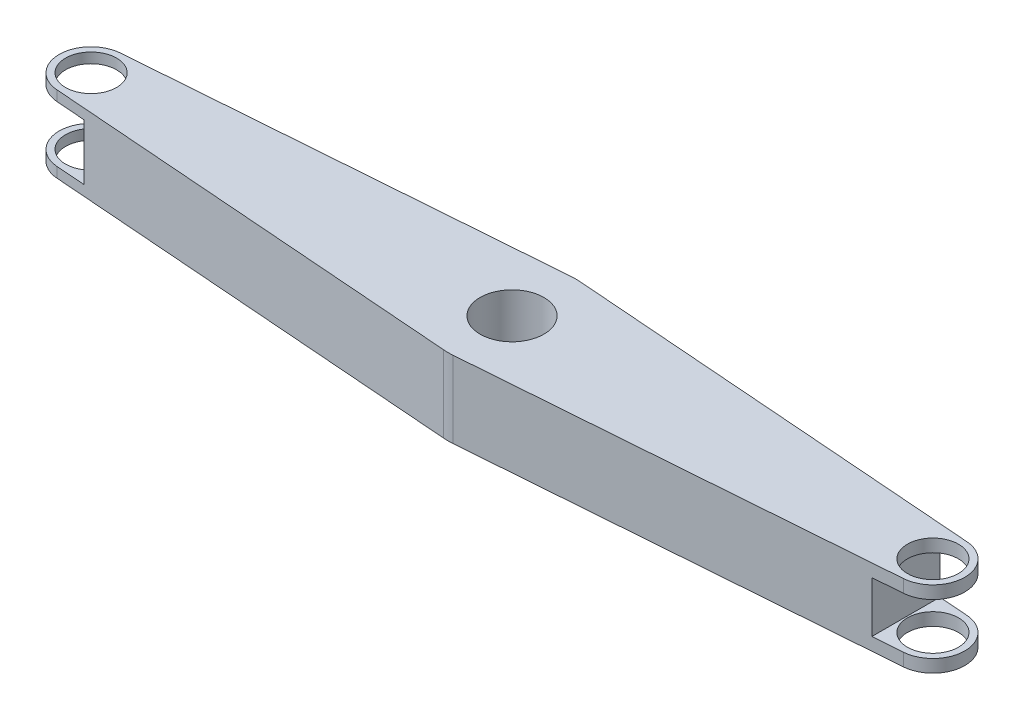
ISO-10303-21;
HEADER;
FILE_DESCRIPTION(('STEP AP214'),'2;1');
FILE_NAME('part.step','',(''),(''),'','','');
FILE_SCHEMA(('AUTOMOTIVE_DESIGN { 1 0 10303 214 1 1 1 1 }'));
ENDSEC;
DATA;
#1=APPLICATION_CONTEXT('core data for automotive mechanical design processes');
#2=APPLICATION_PROTOCOL_DEFINITION('international standard','automotive_design',2000,#1);
#3=PRODUCT_CONTEXT('',#1,'mechanical');
#4=PRODUCT('Part','Part','',(#3));
#5=PRODUCT_RELATED_PRODUCT_CATEGORY('part','',(#4));
#6=PRODUCT_DEFINITION_FORMATION('','',#4);
#7=PRODUCT_DEFINITION_CONTEXT('part definition',#1,'design');
#8=PRODUCT_DEFINITION('design','',#6,#7);
#9=PRODUCT_DEFINITION_SHAPE('','',#8);
#10=(LENGTH_UNIT() NAMED_UNIT(*) SI_UNIT(.MILLI.,.METRE.));
#11=(NAMED_UNIT(*) PLANE_ANGLE_UNIT() SI_UNIT($,.RADIAN.));
#12=(NAMED_UNIT(*) SI_UNIT($,.STERADIAN.) SOLID_ANGLE_UNIT());
#13=UNCERTAINTY_MEASURE_WITH_UNIT(LENGTH_MEASURE(1.E-05),#10,'distance_accuracy_value','');
#14=(GEOMETRIC_REPRESENTATION_CONTEXT(3) GLOBAL_UNCERTAINTY_ASSIGNED_CONTEXT((#13)) GLOBAL_UNIT_ASSIGNED_CONTEXT((#10,
#11,#12)) REPRESENTATION_CONTEXT('',''));
#15=CARTESIAN_POINT('',(0.,0.,0.));
#16=DIRECTION('',(0.,0.,1.));
#17=DIRECTION('',(1.,0.,0.));
#18=AXIS2_PLACEMENT_3D('',#15,#16,#17);
#19=CARTESIAN_POINT('',(-165.,15.,0.));
#20=DIRECTION('',(0.,-1.,0.));
#21=DIRECTION('',(0.,0.,-1.));
#22=AXIS2_PLACEMENT_3D('',#19,#20,#21);
#23=CYLINDRICAL_SURFACE('',#22,12.5);
#24=DIRECTION('',(0.,-1.,0.));
#25=VECTOR('',#24,1.);
#26=CARTESIAN_POINT('',(-165.94696969697,15.,-12.4640783210401));
#27=LINE('',#26,#25);
#28=CARTESIAN_POINT('',(-165.94696969697,15.,-12.4640783210401));
#29=VERTEX_POINT('',#28);
#30=CARTESIAN_POINT('',(-165.94696969697,11.,-12.4640783210401));
#31=VERTEX_POINT('',#30);
#32=EDGE_CURVE('E240',#29,#31,#27,.T.);
#33=ORIENTED_EDGE('',*,*,#32,.T.);
#34=CARTESIAN_POINT('',(-165.,11.,0.));
#35=DIRECTION('',(0.,1.,0.));
#36=DIRECTION('',(0.,0.,1.));
#37=AXIS2_PLACEMENT_3D('',#34,#35,#36);
#38=CIRCLE('',#37,12.5);
#39=CARTESIAN_POINT('',(-165.94696969697,11.,12.4640783210401));
#40=VERTEX_POINT('',#39);
#41=EDGE_CURVE('E175',#31,#40,#38,.T.);
#42=ORIENTED_EDGE('',*,*,#41,.T.);
#43=DIRECTION('',(0.,-1.,0.));
#44=VECTOR('',#43,1.);
#45=CARTESIAN_POINT('',(-165.94696969697,15.,12.4640783210401));
#46=LINE('',#45,#44);
#47=CARTESIAN_POINT('',(-165.94696969697,15.,12.4640783210401));
#48=VERTEX_POINT('',#47);
#49=EDGE_CURVE('E264',#48,#40,#46,.T.);
#50=ORIENTED_EDGE('',*,*,#49,.F.);
#51=CARTESIAN_POINT('',(-165.,15.,0.));
#52=DIRECTION('',(0.,1.,0.));
#53=DIRECTION('',(0.,0.,1.));
#54=AXIS2_PLACEMENT_3D('',#51,#52,#53);
#55=CIRCLE('',#54,12.5);
#56=EDGE_CURVE('E203',#29,#48,#55,.T.);
#57=ORIENTED_EDGE('',*,*,#56,.F.);
#58=EDGE_LOOP('',(#33,#42,#50,#57));
#59=FACE_BOUND('',#58,.T.);
#60=ADVANCED_FACE('F39',(#59),#23,.T.);
#61=CARTESIAN_POINT('',(165.,15.,0.));
#62=DIRECTION('',(0.,-1.,0.));
#63=DIRECTION('',(0.,0.,-1.));
#64=AXIS2_PLACEMENT_3D('',#61,#62,#63);
#65=CYLINDRICAL_SURFACE('',#64,12.5);
#66=DIRECTION('',(0.,-1.,0.));
#67=VECTOR('',#66,1.);
#68=CARTESIAN_POINT('',(165.94696969697,15.,-12.4640783210401));
#69=LINE('',#68,#67);
#70=CARTESIAN_POINT('',(165.94696969697,-10.,-12.4640783210401));
#71=VERTEX_POINT('',#70);
#72=CARTESIAN_POINT('',(165.94696969697,-15.,-12.4640783210401));
#73=VERTEX_POINT('',#72);
#74=EDGE_CURVE('E249',#71,#73,#69,.T.);
#75=ORIENTED_EDGE('',*,*,#74,.F.);
#76=CARTESIAN_POINT('',(165.,-10.,0.));
#77=DIRECTION('',(0.,-1.,0.));
#78=DIRECTION('',(1.,0.,0.));
#79=AXIS2_PLACEMENT_3D('',#76,#77,#78);
#80=CIRCLE('',#79,12.5);
#81=CARTESIAN_POINT('',(165.94696969697,-10.,12.4640783210401));
#82=VERTEX_POINT('',#81);
#83=EDGE_CURVE('E190',#71,#82,#80,.T.);
#84=ORIENTED_EDGE('',*,*,#83,.T.);
#85=DIRECTION('',(0.,-1.,0.));
#86=VECTOR('',#85,1.);
#87=CARTESIAN_POINT('',(165.94696969697,15.,12.4640783210401));
#88=LINE('',#87,#86);
#89=CARTESIAN_POINT('',(165.94696969697,-15.,12.4640783210401));
#90=VERTEX_POINT('',#89);
#91=EDGE_CURVE('E253',#82,#90,#88,.T.);
#92=ORIENTED_EDGE('',*,*,#91,.T.);
#93=CARTESIAN_POINT('',(165.,-15.,0.));
#94=DIRECTION('',(0.,1.,0.));
#95=DIRECTION('',(0.,0.,1.));
#96=AXIS2_PLACEMENT_3D('',#93,#94,#95);
#97=CIRCLE('',#96,12.5);
#98=EDGE_CURVE('E231',#90,#73,#97,.T.);
#99=ORIENTED_EDGE('',*,*,#98,.T.);
#100=EDGE_LOOP('',(#75,#84,#92,#99));
#101=FACE_BOUND('',#100,.T.);
#102=ADVANCED_FACE('F347',(#101),#65,.T.);
#103=CARTESIAN_POINT('',(-165.,15.,0.));
#104=DIRECTION('',(0.,1.,0.));
#105=DIRECTION('',(0.,0.,1.));
#106=AXIS2_PLACEMENT_3D('',#103,#104,#105);
#107=PLANE('',#106);
#108=CARTESIAN_POINT('',(-165.,15.,0.));
#109=DIRECTION('',(0.,1.,0.));
#110=DIRECTION('',(0.,0.,1.));
#111=AXIS2_PLACEMENT_3D('',#108,#109,#110);
#112=CIRCLE('',#111,10.);
#113=CARTESIAN_POINT('',(-165.,15.,10.));
#114=VERTEX_POINT('',#113);
#115=EDGE_CURVE('E285',#114,#114,#112,.T.);
#116=ORIENTED_EDGE('',*,*,#115,.F.);
#117=EDGE_LOOP('',(#116));
#118=FACE_BOUND('',#117,.T.);
#119=CARTESIAN_POINT('',(165.,15.,0.));
#120=DIRECTION('',(0.,1.,0.));
#121=DIRECTION('',(0.,0.,1.));
#122=AXIS2_PLACEMENT_3D('',#119,#120,#121);
#123=CIRCLE('',#122,10.);
#124=CARTESIAN_POINT('',(165.,15.,10.));
#125=VERTEX_POINT('',#124);
#126=EDGE_CURVE('E290',#125,#125,#123,.T.);
#127=ORIENTED_EDGE('',*,*,#126,.F.);
#128=EDGE_LOOP('',(#127));
#129=FACE_BOUND('',#128,.T.);
#130=ORIENTED_EDGE('',*,*,#56,.T.);
#131=DIRECTION('',(0.997126265683206,0.,0.0757575757575758));
#132=VECTOR('',#131,1.);
#133=CARTESIAN_POINT('',(-165.94696969697,15.,12.4640783210401));
#134=LINE('',#133,#132);
#135=CARTESIAN_POINT('',(-1.8939393939394,15.,24.9281566420802));
#136=VERTEX_POINT('',#135);
#137=EDGE_CURVE('E206',#48,#136,#134,.T.);
#138=ORIENTED_EDGE('',*,*,#137,.T.);
#139=CARTESIAN_POINT('',(0.,15.,0.));
#140=DIRECTION('',(0.,1.,0.));
#141=DIRECTION('',(0.,0.,1.));
#142=AXIS2_PLACEMENT_3D('',#139,#140,#141);
#143=CIRCLE('',#142,25.);
#144=CARTESIAN_POINT('',(1.8939393939394,15.,24.9281566420802));
#145=VERTEX_POINT('',#144);
#146=EDGE_CURVE('E209',#136,#145,#143,.T.);
#147=ORIENTED_EDGE('',*,*,#146,.T.);
#148=DIRECTION('',(0.997126265683206,0.,-0.0757575757575758));
#149=VECTOR('',#148,1.);
#150=CARTESIAN_POINT('',(165.94696969697,15.,12.4640783210401));
#151=LINE('',#150,#149);
#152=CARTESIAN_POINT('',(165.94696969697,15.,12.4640783210401));
#153=VERTEX_POINT('',#152);
#154=EDGE_CURVE('E211',#145,#153,#151,.T.);
#155=ORIENTED_EDGE('',*,*,#154,.T.);
#156=CARTESIAN_POINT('',(165.,15.,0.));
#157=DIRECTION('',(0.,1.,0.));
#158=DIRECTION('',(0.,0.,1.));
#159=AXIS2_PLACEMENT_3D('',#156,#157,#158);
#160=CIRCLE('',#159,12.5);
#161=CARTESIAN_POINT('',(165.94696969697,15.,-12.4640783210401));
#162=VERTEX_POINT('',#161);
#163=EDGE_CURVE('E213',#153,#162,#160,.T.);
#164=ORIENTED_EDGE('',*,*,#163,.T.);
#165=DIRECTION('',(-0.997126265683206,0.,-0.0757575757575758));
#166=VECTOR('',#165,1.);
#167=CARTESIAN_POINT('',(165.94696969697,15.,-12.4640783210401));
#168=LINE('',#167,#166);
#169=CARTESIAN_POINT('',(1.89393939393939,15.,-24.9281566420802));
#170=VERTEX_POINT('',#169);
#171=EDGE_CURVE('E215',#162,#170,#168,.T.);
#172=ORIENTED_EDGE('',*,*,#171,.T.);
#173=CARTESIAN_POINT('',(0.,15.,0.));
#174=DIRECTION('',(0.,1.,0.));
#175=DIRECTION('',(0.,0.,1.));
#176=AXIS2_PLACEMENT_3D('',#173,#174,#175);
#177=CIRCLE('',#176,25.);
#178=CARTESIAN_POINT('',(-1.8939393939394,15.,-24.9281566420802));
#179=VERTEX_POINT('',#178);
#180=EDGE_CURVE('E217',#170,#179,#177,.T.);
#181=ORIENTED_EDGE('',*,*,#180,.T.);
#182=DIRECTION('',(-0.997126265683206,0.,0.0757575757575758));
#183=VECTOR('',#182,1.);
#184=CARTESIAN_POINT('',(-165.94696969697,15.,-12.4640783210401));
#185=LINE('',#184,#183);
#186=EDGE_CURVE('E219',#179,#29,#185,.T.);
#187=ORIENTED_EDGE('',*,*,#186,.T.);
#188=EDGE_LOOP('',(#130,#138,#147,#155,#164,#172,#181,#187));
#189=FACE_BOUND('',#188,.T.);
#190=CARTESIAN_POINT('',(0.,15.,0.));
#191=DIRECTION('',(0.,1.,0.));
#192=DIRECTION('',(0.,0.,1.));
#193=AXIS2_PLACEMENT_3D('',#190,#191,#192);
#194=CIRCLE('',#193,12.5);
#195=CARTESIAN_POINT('',(0.,15.,12.5));
#196=VERTEX_POINT('',#195);
#197=EDGE_CURVE('E197',#196,#196,#194,.T.);
#198=ORIENTED_EDGE('',*,*,#197,.F.);
#199=EDGE_LOOP('',(#198));
#200=FACE_BOUND('',#199,.T.);
#201=ADVANCED_FACE('F327',(#118,#129,#189,#200),#107,.T.);
#202=CARTESIAN_POINT('',(-165.,-15.,0.));
#203=DIRECTION('',(0.,1.,0.));
#204=DIRECTION('',(0.,0.,1.));
#205=AXIS2_PLACEMENT_3D('',#202,#203,#204);
#206=PLANE('',#205);
#207=CARTESIAN_POINT('',(-165.,-15.,0.));
#208=DIRECTION('',(0.,1.,0.));
#209=DIRECTION('',(0.,0.,1.));
#210=AXIS2_PLACEMENT_3D('',#207,#208,#209);
#211=CIRCLE('',#210,10.);
#212=CARTESIAN_POINT('',(-165.,-15.,10.));
#213=VERTEX_POINT('',#212);
#214=EDGE_CURVE('E279',#213,#213,#211,.T.);
#215=ORIENTED_EDGE('',*,*,#214,.T.);
#216=EDGE_LOOP('',(#215));
#217=FACE_BOUND('',#216,.T.);
#218=CARTESIAN_POINT('',(165.,-15.,0.));
#219=DIRECTION('',(0.,1.,0.));
#220=DIRECTION('',(0.,0.,1.));
#221=AXIS2_PLACEMENT_3D('',#218,#219,#220);
#222=CIRCLE('',#221,10.);
#223=CARTESIAN_POINT('',(165.,-15.,10.));
#224=VERTEX_POINT('',#223);
#225=EDGE_CURVE('E293',#224,#224,#222,.T.);
#226=ORIENTED_EDGE('',*,*,#225,.T.);
#227=EDGE_LOOP('',(#226));
#228=FACE_BOUND('',#227,.T.);
#229=CARTESIAN_POINT('',(-165.,-15.,0.));
#230=DIRECTION('',(0.,1.,0.));
#231=DIRECTION('',(0.,0.,1.));
#232=AXIS2_PLACEMENT_3D('',#229,#230,#231);
#233=CIRCLE('',#232,12.5);
#234=CARTESIAN_POINT('',(-165.94696969697,-15.,-12.4640783210401));
#235=VERTEX_POINT('',#234);
#236=CARTESIAN_POINT('',(-165.94696969697,-15.,12.4640783210401));
#237=VERTEX_POINT('',#236);
#238=EDGE_CURVE('E200',#235,#237,#233,.T.);
#239=ORIENTED_EDGE('',*,*,#238,.F.);
#240=DIRECTION('',(-0.997126265683206,0.,0.0757575757575758));
#241=VECTOR('',#240,1.);
#242=CARTESIAN_POINT('',(-165.94696969697,-15.,-12.4640783210401));
#243=LINE('',#242,#241);
#244=CARTESIAN_POINT('',(-1.8939393939394,-15.,-24.9281566420802));
#245=VERTEX_POINT('',#244);
#246=EDGE_CURVE('E207',#245,#235,#243,.T.);
#247=ORIENTED_EDGE('',*,*,#246,.F.);
#248=CARTESIAN_POINT('',(0.,-15.,0.));
#249=DIRECTION('',(0.,1.,0.));
#250=DIRECTION('',(0.,0.,1.));
#251=AXIS2_PLACEMENT_3D('',#248,#249,#250);
#252=CIRCLE('',#251,25.);
#253=CARTESIAN_POINT('',(1.89393939393939,-15.,-24.9281566420802));
#254=VERTEX_POINT('',#253);
#255=EDGE_CURVE('E236',#254,#245,#252,.T.);
#256=ORIENTED_EDGE('',*,*,#255,.F.);
#257=DIRECTION('',(-0.997126265683206,0.,-0.0757575757575758));
#258=VECTOR('',#257,1.);
#259=CARTESIAN_POINT('',(165.94696969697,-15.,-12.4640783210401));
#260=LINE('',#259,#258);
#261=EDGE_CURVE('E234',#73,#254,#260,.T.);
#262=ORIENTED_EDGE('',*,*,#261,.F.);
#263=ORIENTED_EDGE('',*,*,#98,.F.);
#264=DIRECTION('',(0.997126265683206,0.,-0.0757575757575758));
#265=VECTOR('',#264,1.);
#266=CARTESIAN_POINT('',(165.94696969697,-15.,12.4640783210401));
#267=LINE('',#266,#265);
#268=CARTESIAN_POINT('',(1.8939393939394,-15.,24.9281566420802));
#269=VERTEX_POINT('',#268);
#270=EDGE_CURVE('E228',#269,#90,#267,.T.);
#271=ORIENTED_EDGE('',*,*,#270,.F.);
#272=CARTESIAN_POINT('',(0.,-15.,0.));
#273=DIRECTION('',(0.,1.,0.));
#274=DIRECTION('',(0.,0.,1.));
#275=AXIS2_PLACEMENT_3D('',#272,#273,#274);
#276=CIRCLE('',#275,25.);
#277=CARTESIAN_POINT('',(-1.8939393939394,-15.,24.9281566420802));
#278=VERTEX_POINT('',#277);
#279=EDGE_CURVE('E226',#278,#269,#276,.T.);
#280=ORIENTED_EDGE('',*,*,#279,.F.);
#281=DIRECTION('',(0.997126265683206,0.,0.0757575757575758));
#282=VECTOR('',#281,1.);
#283=CARTESIAN_POINT('',(-165.94696969697,-15.,12.4640783210401));
#284=LINE('',#283,#282);
#285=EDGE_CURVE('E224',#237,#278,#284,.T.);
#286=ORIENTED_EDGE('',*,*,#285,.F.);
#287=EDGE_LOOP('',(#239,#247,#256,#262,#263,#271,#280,#286));
#288=FACE_BOUND('',#287,.T.);
#289=CARTESIAN_POINT('',(0.,-15.,0.));
#290=DIRECTION('',(0.,1.,0.));
#291=DIRECTION('',(0.,0.,1.));
#292=AXIS2_PLACEMENT_3D('',#289,#290,#291);
#293=CIRCLE('',#292,12.5);
#294=CARTESIAN_POINT('',(0.,-15.,12.5));
#295=VERTEX_POINT('',#294);
#296=EDGE_CURVE('E196',#295,#295,#293,.T.);
#297=ORIENTED_EDGE('',*,*,#296,.T.);
#298=EDGE_LOOP('',(#297));
#299=FACE_BOUND('',#298,.T.);
#300=ADVANCED_FACE('F316',(#217,#228,#288,#299),#206,.F.);
#301=CARTESIAN_POINT('',(-165.94696969697,-11.,12.4640783210401));
#302=VERTEX_POINT('',#301);
#303=EDGE_CURVE('E263',#302,#237,#46,.T.);
#304=ORIENTED_EDGE('',*,*,#303,.F.);
#305=CARTESIAN_POINT('',(-165.,-11.,0.));
#306=DIRECTION('',(0.,-1.,0.));
#307=DIRECTION('',(0.,0.,-1.));
#308=AXIS2_PLACEMENT_3D('',#305,#306,#307);
#309=CIRCLE('',#308,12.5);
#310=CARTESIAN_POINT('',(-165.94696969697,-11.,-12.4640783210401));
#311=VERTEX_POINT('',#310);
#312=EDGE_CURVE('E156',#302,#311,#309,.T.);
#313=ORIENTED_EDGE('',*,*,#312,.T.);
#314=EDGE_CURVE('E221',#311,#235,#27,.T.);
#315=ORIENTED_EDGE('',*,*,#314,.T.);
#316=ORIENTED_EDGE('',*,*,#238,.T.);
#317=EDGE_LOOP('',(#304,#313,#315,#316));
#318=FACE_BOUND('',#317,.T.);
#319=ADVANCED_FACE('F41',(#318),#23,.T.);
#320=CARTESIAN_POINT('',(-165.94696969697,15.,12.4640783210401));
#321=DIRECTION('',(0.0757575757575758,0.,-0.997126265683206));
#322=DIRECTION('',(-0.997126265683206,0.,-0.0757575757575758));
#323=AXIS2_PLACEMENT_3D('',#320,#321,#322);
#324=PLANE('',#323);
#325=ORIENTED_EDGE('',*,*,#49,.T.);
#326=DIRECTION('',(0.997126265683206,0.,0.0757575757575758));
#327=VECTOR('',#326,1.);
#328=CARTESIAN_POINT('',(-165.94696969697,11.,12.4640783210401));
#329=LINE('',#328,#327);
#330=CARTESIAN_POINT('',(-154.393939393939,11.,13.3418303154795));
#331=VERTEX_POINT('',#330);
#332=EDGE_CURVE('E174',#40,#331,#329,.T.);
#333=ORIENTED_EDGE('',*,*,#332,.T.);
#334=DIRECTION('',(0.,-1.,0.));
#335=VECTOR('',#334,1.);
#336=CARTESIAN_POINT('',(-154.393939393939,15.,13.3418303154795));
#337=LINE('',#336,#335);
#338=CARTESIAN_POINT('',(-154.393939393939,-11.,13.3418303154795));
#339=VERTEX_POINT('',#338);
#340=EDGE_CURVE('E160',#331,#339,#337,.T.);
#341=ORIENTED_EDGE('',*,*,#340,.T.);
#342=DIRECTION('',(-0.997126265683206,0.,-0.0757575757575758));
#343=VECTOR('',#342,1.);
#344=CARTESIAN_POINT('',(-165.94696969697,-11.,12.4640783210401));
#345=LINE('',#344,#343);
#346=EDGE_CURVE('E154',#339,#302,#345,.T.);
#347=ORIENTED_EDGE('',*,*,#346,.T.);
#348=ORIENTED_EDGE('',*,*,#303,.T.);
#349=ORIENTED_EDGE('',*,*,#285,.T.);
#350=DIRECTION('',(0.,-1.,0.));
#351=VECTOR('',#350,1.);
#352=CARTESIAN_POINT('',(-1.8939393939394,15.,24.9281566420802));
#353=LINE('',#352,#351);
#354=EDGE_CURVE('E260',#136,#278,#353,.T.);
#355=ORIENTED_EDGE('',*,*,#354,.F.);
#356=ORIENTED_EDGE('',*,*,#137,.F.);
#357=EDGE_LOOP('',(#325,#333,#341,#347,#348,#349,#355,#356));
#358=FACE_BOUND('',#357,.T.);
#359=ADVANCED_FACE('F173',(#358),#324,.F.);
#360=CARTESIAN_POINT('',(0.,15.,0.));
#361=DIRECTION('',(0.,-1.,0.));
#362=DIRECTION('',(0.,0.,-1.));
#363=AXIS2_PLACEMENT_3D('',#360,#361,#362);
#364=CYLINDRICAL_SURFACE('',#363,25.);
#365=ORIENTED_EDGE('',*,*,#279,.T.);
#366=DIRECTION('',(0.,-1.,0.));
#367=VECTOR('',#366,1.);
#368=CARTESIAN_POINT('',(1.8939393939394,15.,24.9281566420802));
#369=LINE('',#368,#367);
#370=EDGE_CURVE('E257',#145,#269,#369,.T.);
#371=ORIENTED_EDGE('',*,*,#370,.F.);
#372=ORIENTED_EDGE('',*,*,#146,.F.);
#373=ORIENTED_EDGE('',*,*,#354,.T.);
#374=EDGE_LOOP('',(#365,#371,#372,#373));
#375=FACE_BOUND('',#374,.T.);
#376=ADVANCED_FACE('F323',(#375),#364,.T.);
#377=CARTESIAN_POINT('',(165.94696969697,15.,12.4640783210401));
#378=DIRECTION('',(-0.0757575757575758,0.,-0.997126265683206));
#379=DIRECTION('',(-0.997126265683206,0.,0.0757575757575758));
#380=AXIS2_PLACEMENT_3D('',#377,#378,#379);
#381=PLANE('',#380);
#382=ORIENTED_EDGE('',*,*,#91,.F.);
#383=DIRECTION('',(-0.997126265683206,0.,0.0757575757575758));
#384=VECTOR('',#383,1.);
#385=CARTESIAN_POINT('',(165.94696969697,-10.,12.4640783210401));
#386=LINE('',#385,#384);
#387=CARTESIAN_POINT('',(154.393939393939,-10.,13.3418303154795));
#388=VERTEX_POINT('',#387);
#389=EDGE_CURVE('E193',#82,#388,#386,.T.);
#390=ORIENTED_EDGE('',*,*,#389,.T.);
#391=DIRECTION('',(0.,1.,0.));
#392=VECTOR('',#391,1.);
#393=CARTESIAN_POINT('',(154.393939393939,15.,13.3418303154795));
#394=LINE('',#393,#392);
#395=CARTESIAN_POINT('',(154.393939393939,10.,13.3418303154795));
#396=VERTEX_POINT('',#395);
#397=EDGE_CURVE('E187',#388,#396,#394,.T.);
#398=ORIENTED_EDGE('',*,*,#397,.T.);
#399=DIRECTION('',(0.997126265683206,0.,-0.0757575757575758));
#400=VECTOR('',#399,1.);
#401=CARTESIAN_POINT('',(165.94696969697,10.,12.4640783210401));
#402=LINE('',#401,#400);
#403=CARTESIAN_POINT('',(165.94696969697,10.,12.4640783210401));
#404=VERTEX_POINT('',#403);
#405=EDGE_CURVE('E184',#396,#404,#402,.T.);
#406=ORIENTED_EDGE('',*,*,#405,.T.);
#407=EDGE_CURVE('E254',#153,#404,#88,.T.);
#408=ORIENTED_EDGE('',*,*,#407,.F.);
#409=ORIENTED_EDGE('',*,*,#154,.F.);
#410=ORIENTED_EDGE('',*,*,#370,.T.);
#411=ORIENTED_EDGE('',*,*,#270,.T.);
#412=EDGE_LOOP('',(#382,#390,#398,#406,#408,#409,#410,#411));
#413=FACE_BOUND('',#412,.T.);
#414=ADVANCED_FACE('F350',(#413),#381,.F.);
#415=CARTESIAN_POINT('',(165.,10.,0.));
#416=DIRECTION('',(0.,1.,0.));
#417=DIRECTION('',(0.,0.,1.));
#418=AXIS2_PLACEMENT_3D('',#415,#416,#417);
#419=CIRCLE('',#418,12.5);
#420=CARTESIAN_POINT('',(165.94696969697,10.,-12.4640783210401));
#421=VERTEX_POINT('',#420);
#422=EDGE_CURVE('E182',#404,#421,#419,.T.);
#423=ORIENTED_EDGE('',*,*,#422,.T.);
#424=EDGE_CURVE('E250',#162,#421,#69,.T.);
#425=ORIENTED_EDGE('',*,*,#424,.F.);
#426=ORIENTED_EDGE('',*,*,#163,.F.);
#427=ORIENTED_EDGE('',*,*,#407,.T.);
#428=EDGE_LOOP('',(#423,#425,#426,#427));
#429=FACE_BOUND('',#428,.T.);
#430=ADVANCED_FACE('F354',(#429),#65,.T.);
#431=CARTESIAN_POINT('',(165.94696969697,15.,-12.4640783210401));
#432=DIRECTION('',(-0.0757575757575758,0.,0.997126265683206));
#433=DIRECTION('',(0.997126265683206,0.,0.0757575757575758));
#434=AXIS2_PLACEMENT_3D('',#431,#432,#433);
#435=PLANE('',#434);
#436=DIRECTION('',(0.,-1.,0.));
#437=VECTOR('',#436,1.);
#438=CARTESIAN_POINT('',(154.393939393939,15.,-13.3418303154795));
#439=LINE('',#438,#437);
#440=CARTESIAN_POINT('',(154.393939393939,10.,-13.3418303154795));
#441=VERTEX_POINT('',#440);
#442=CARTESIAN_POINT('',(154.393939393939,-10.,-13.3418303154795));
#443=VERTEX_POINT('',#442);
#444=EDGE_CURVE('E48',#441,#443,#439,.T.);
#445=ORIENTED_EDGE('',*,*,#444,.T.);
#446=DIRECTION('',(0.997126265683206,0.,0.0757575757575758));
#447=VECTOR('',#446,1.);
#448=CARTESIAN_POINT('',(165.94696969697,-10.,-12.4640783210401));
#449=LINE('',#448,#447);
#450=EDGE_CURVE('E11',#443,#71,#449,.T.);
#451=ORIENTED_EDGE('',*,*,#450,.T.);
#452=ORIENTED_EDGE('',*,*,#74,.T.);
#453=ORIENTED_EDGE('',*,*,#261,.T.);
#454=DIRECTION('',(0.,-1.,0.));
#455=VECTOR('',#454,1.);
#456=CARTESIAN_POINT('',(1.89393939393939,15.,-24.9281566420802));
#457=LINE('',#456,#455);
#458=EDGE_CURVE('E246',#170,#254,#457,.T.);
#459=ORIENTED_EDGE('',*,*,#458,.F.);
#460=ORIENTED_EDGE('',*,*,#171,.F.);
#461=ORIENTED_EDGE('',*,*,#424,.T.);
#462=DIRECTION('',(-0.997126265683206,0.,-0.0757575757575758));
#463=VECTOR('',#462,1.);
#464=CARTESIAN_POINT('',(165.94696969697,10.,-12.4640783210401));
#465=LINE('',#464,#463);
#466=EDGE_CURVE('E272',#421,#441,#465,.T.);
#467=ORIENTED_EDGE('',*,*,#466,.T.);
#468=EDGE_LOOP('',(#445,#451,#452,#453,#459,#460,#461,#467));
#469=FACE_BOUND('',#468,.T.);
#470=ADVANCED_FACE('F344',(#469),#435,.F.);
#471=CARTESIAN_POINT('',(0.,15.,0.));
#472=DIRECTION('',(0.,-1.,0.));
#473=DIRECTION('',(0.,0.,-1.));
#474=AXIS2_PLACEMENT_3D('',#471,#472,#473);
#475=CYLINDRICAL_SURFACE('',#474,25.);
#476=ORIENTED_EDGE('',*,*,#255,.T.);
#477=DIRECTION('',(0.,-1.,0.));
#478=VECTOR('',#477,1.);
#479=CARTESIAN_POINT('',(-1.8939393939394,15.,-24.9281566420802));
#480=LINE('',#479,#478);
#481=EDGE_CURVE('E243',#179,#245,#480,.T.);
#482=ORIENTED_EDGE('',*,*,#481,.F.);
#483=ORIENTED_EDGE('',*,*,#180,.F.);
#484=ORIENTED_EDGE('',*,*,#458,.T.);
#485=EDGE_LOOP('',(#476,#482,#483,#484));
#486=FACE_BOUND('',#485,.T.);
#487=ADVANCED_FACE('F340',(#486),#475,.T.);
#488=CARTESIAN_POINT('',(-165.94696969697,15.,-12.4640783210401));
#489=DIRECTION('',(0.0757575757575758,0.,0.997126265683206));
#490=DIRECTION('',(0.997126265683206,0.,-0.0757575757575758));
#491=AXIS2_PLACEMENT_3D('',#488,#489,#490);
#492=PLANE('',#491);
#493=DIRECTION('',(0.,1.,0.));
#494=VECTOR('',#493,1.);
#495=CARTESIAN_POINT('',(-154.393939393939,15.,-13.3418303154795));
#496=LINE('',#495,#494);
#497=CARTESIAN_POINT('',(-154.393939393939,-11.,-13.3418303154795));
#498=VERTEX_POINT('',#497);
#499=CARTESIAN_POINT('',(-154.393939393939,11.,-13.3418303154795));
#500=VERTEX_POINT('',#499);
#501=EDGE_CURVE('E167',#498,#500,#496,.T.);
#502=ORIENTED_EDGE('',*,*,#501,.T.);
#503=DIRECTION('',(-0.997126265683206,0.,0.0757575757575758));
#504=VECTOR('',#503,1.);
#505=CARTESIAN_POINT('',(-165.94696969697,11.,-12.4640783210401));
#506=LINE('',#505,#504);
#507=EDGE_CURVE('E269',#500,#31,#506,.T.);
#508=ORIENTED_EDGE('',*,*,#507,.T.);
#509=ORIENTED_EDGE('',*,*,#32,.F.);
#510=ORIENTED_EDGE('',*,*,#186,.F.);
#511=ORIENTED_EDGE('',*,*,#481,.T.);
#512=ORIENTED_EDGE('',*,*,#246,.T.);
#513=ORIENTED_EDGE('',*,*,#314,.F.);
#514=DIRECTION('',(0.997126265683206,0.,-0.0757575757575758));
#515=VECTOR('',#514,1.);
#516=CARTESIAN_POINT('',(-165.94696969697,-11.,-12.4640783210401));
#517=LINE('',#516,#515);
#518=EDGE_CURVE('E266',#311,#498,#517,.T.);
#519=ORIENTED_EDGE('',*,*,#518,.T.);
#520=EDGE_LOOP('',(#502,#508,#509,#510,#511,#512,#513,#519));
#521=FACE_BOUND('',#520,.T.);
#522=ADVANCED_FACE('F308',(#521),#492,.F.);
#523=CARTESIAN_POINT('',(0.,15.,0.));
#524=DIRECTION('',(0.,-1.,0.));
#525=DIRECTION('',(0.,0.,-1.));
#526=AXIS2_PLACEMENT_3D('',#523,#524,#525);
#527=CYLINDRICAL_SURFACE('',#526,12.5);
#528=ORIENTED_EDGE('',*,*,#197,.T.);
#529=EDGE_LOOP('',(#528));
#530=FACE_BOUND('',#529,.T.);
#531=ORIENTED_EDGE('',*,*,#296,.F.);
#532=EDGE_LOOP('',(#531));
#533=FACE_BOUND('',#532,.T.);
#534=ADVANCED_FACE('F396',(#530,#533),#527,.F.);
#535=CARTESIAN_POINT('',(-154.393939393939,11.,-25.));
#536=DIRECTION('',(0.,1.,0.));
#537=DIRECTION('',(0.,0.,1.));
#538=AXIS2_PLACEMENT_3D('',#535,#536,#537);
#539=PLANE('',#538);
#540=CARTESIAN_POINT('',(-165.,11.,0.));
#541=DIRECTION('',(0.,1.,0.));
#542=DIRECTION('',(0.,0.,1.));
#543=AXIS2_PLACEMENT_3D('',#540,#541,#542);
#544=CIRCLE('',#543,10.);
#545=CARTESIAN_POINT('',(-165.,11.,10.));
#546=VERTEX_POINT('',#545);
#547=EDGE_CURVE('E298',#546,#546,#544,.T.);
#548=ORIENTED_EDGE('',*,*,#547,.T.);
#549=EDGE_LOOP('',(#548));
#550=FACE_BOUND('',#549,.T.);
#551=ORIENTED_EDGE('',*,*,#41,.F.);
#552=ORIENTED_EDGE('',*,*,#507,.F.);
#553=DIRECTION('',(0.,0.,1.));
#554=VECTOR('',#553,1.);
#555=CARTESIAN_POINT('',(-154.393939393939,11.,-25.));
#556=LINE('',#555,#554);
#557=EDGE_CURVE('E169',#500,#331,#556,.T.);
#558=ORIENTED_EDGE('',*,*,#557,.T.);
#559=ORIENTED_EDGE('',*,*,#332,.F.);
#560=EDGE_LOOP('',(#551,#552,#558,#559));
#561=FACE_BOUND('',#560,.T.);
#562=ADVANCED_FACE('F335',(#550,#561),#539,.F.);
#563=CARTESIAN_POINT('',(-154.393939393939,-11.,-25.));
#564=DIRECTION('',(1.,0.,0.));
#565=DIRECTION('',(0.,0.,-1.));
#566=AXIS2_PLACEMENT_3D('',#563,#564,#565);
#567=PLANE('',#566);
#568=ORIENTED_EDGE('',*,*,#557,.F.);
#569=ORIENTED_EDGE('',*,*,#501,.F.);
#570=DIRECTION('',(0.,0.,1.));
#571=VECTOR('',#570,1.);
#572=CARTESIAN_POINT('',(-154.393939393939,-11.,-25.));
#573=LINE('',#572,#571);
#574=EDGE_CURVE('E64',#498,#339,#573,.T.);
#575=ORIENTED_EDGE('',*,*,#574,.T.);
#576=ORIENTED_EDGE('',*,*,#340,.F.);
#577=EDGE_LOOP('',(#568,#569,#575,#576));
#578=FACE_BOUND('',#577,.T.);
#579=ADVANCED_FACE('F164',(#578),#567,.F.);
#580=CARTESIAN_POINT('',(-154.393939393939,-11.,-25.));
#581=DIRECTION('',(0.,-1.,0.));
#582=DIRECTION('',(0.,0.,-1.));
#583=AXIS2_PLACEMENT_3D('',#580,#581,#582);
#584=PLANE('',#583);
#585=CARTESIAN_POINT('',(-165.,-11.,0.));
#586=DIRECTION('',(0.,-1.,0.));
#587=DIRECTION('',(0.,0.,-1.));
#588=AXIS2_PLACEMENT_3D('',#585,#586,#587);
#589=CIRCLE('',#588,10.);
#590=CARTESIAN_POINT('',(-165.,-11.,-10.));
#591=VERTEX_POINT('',#590);
#592=EDGE_CURVE('E43',#591,#591,#589,.T.);
#593=ORIENTED_EDGE('',*,*,#592,.T.);
#594=EDGE_LOOP('',(#593));
#595=FACE_BOUND('',#594,.T.);
#596=ORIENTED_EDGE('',*,*,#574,.F.);
#597=ORIENTED_EDGE('',*,*,#518,.F.);
#598=ORIENTED_EDGE('',*,*,#312,.F.);
#599=ORIENTED_EDGE('',*,*,#346,.F.);
#600=EDGE_LOOP('',(#596,#597,#598,#599));
#601=FACE_BOUND('',#600,.T.);
#602=ADVANCED_FACE('F155',(#595,#601),#584,.F.);
#603=CARTESIAN_POINT('',(154.393939393939,-10.,-25.));
#604=DIRECTION('',(0.,-1.,0.));
#605=DIRECTION('',(1.,0.,0.));
#606=AXIS2_PLACEMENT_3D('',#603,#604,#605);
#607=PLANE('',#606);
#608=CARTESIAN_POINT('',(165.,-10.,0.));
#609=DIRECTION('',(0.,-1.,0.));
#610=DIRECTION('',(1.,0.,0.));
#611=AXIS2_PLACEMENT_3D('',#608,#609,#610);
#612=CIRCLE('',#611,10.);
#613=CARTESIAN_POINT('',(175.,-10.,0.));
#614=VERTEX_POINT('',#613);
#615=EDGE_CURVE('E278',#614,#614,#612,.T.);
#616=ORIENTED_EDGE('',*,*,#615,.T.);
#617=EDGE_LOOP('',(#616));
#618=FACE_BOUND('',#617,.T.);
#619=ORIENTED_EDGE('',*,*,#83,.F.);
#620=ORIENTED_EDGE('',*,*,#450,.F.);
#621=DIRECTION('',(0.,0.,1.));
#622=VECTOR('',#621,1.);
#623=CARTESIAN_POINT('',(154.393939393939,-10.,-25.));
#624=LINE('',#623,#622);
#625=EDGE_CURVE('E301',#443,#388,#624,.T.);
#626=ORIENTED_EDGE('',*,*,#625,.T.);
#627=ORIENTED_EDGE('',*,*,#389,.F.);
#628=EDGE_LOOP('',(#619,#620,#626,#627));
#629=FACE_BOUND('',#628,.T.);
#630=ADVANCED_FACE('F360',(#618,#629),#607,.F.);
#631=CARTESIAN_POINT('',(154.393939393939,-10.,-25.));
#632=DIRECTION('',(-1.,0.,0.));
#633=DIRECTION('',(0.,0.,1.));
#634=AXIS2_PLACEMENT_3D('',#631,#632,#633);
#635=PLANE('',#634);
#636=ORIENTED_EDGE('',*,*,#625,.F.);
#637=ORIENTED_EDGE('',*,*,#444,.F.);
#638=DIRECTION('',(0.,0.,1.));
#639=VECTOR('',#638,1.);
#640=CARTESIAN_POINT('',(154.393939393939,10.,-25.));
#641=LINE('',#640,#639);
#642=EDGE_CURVE('E56',#441,#396,#641,.T.);
#643=ORIENTED_EDGE('',*,*,#642,.T.);
#644=ORIENTED_EDGE('',*,*,#397,.F.);
#645=EDGE_LOOP('',(#636,#637,#643,#644));
#646=FACE_BOUND('',#645,.T.);
#647=ADVANCED_FACE('F358',(#646),#635,.F.);
#648=CARTESIAN_POINT('',(154.393939393939,10.,-25.));
#649=DIRECTION('',(0.,1.,0.));
#650=DIRECTION('',(0.,0.,1.));
#651=AXIS2_PLACEMENT_3D('',#648,#649,#650);
#652=PLANE('',#651);
#653=CARTESIAN_POINT('',(165.,10.,0.));
#654=DIRECTION('',(0.,1.,0.));
#655=DIRECTION('',(0.,0.,1.));
#656=AXIS2_PLACEMENT_3D('',#653,#654,#655);
#657=CIRCLE('',#656,10.);
#658=CARTESIAN_POINT('',(165.,10.,10.));
#659=VERTEX_POINT('',#658);
#660=EDGE_CURVE('E276',#659,#659,#657,.T.);
#661=ORIENTED_EDGE('',*,*,#660,.T.);
#662=EDGE_LOOP('',(#661));
#663=FACE_BOUND('',#662,.T.);
#664=ORIENTED_EDGE('',*,*,#642,.F.);
#665=ORIENTED_EDGE('',*,*,#466,.F.);
#666=ORIENTED_EDGE('',*,*,#422,.F.);
#667=ORIENTED_EDGE('',*,*,#405,.F.);
#668=EDGE_LOOP('',(#664,#665,#666,#667));
#669=FACE_BOUND('',#668,.T.);
#670=ADVANCED_FACE('F355',(#663,#669),#652,.F.);
#671=CARTESIAN_POINT('',(165.,-15.,0.));
#672=DIRECTION('',(0.,1.,0.));
#673=DIRECTION('',(0.,0.,1.));
#674=AXIS2_PLACEMENT_3D('',#671,#672,#673);
#675=CYLINDRICAL_SURFACE('',#674,10.);
#676=ORIENTED_EDGE('',*,*,#126,.T.);
#677=EDGE_LOOP('',(#676));
#678=FACE_BOUND('',#677,.T.);
#679=ORIENTED_EDGE('',*,*,#660,.F.);
#680=EDGE_LOOP('',(#679));
#681=FACE_BOUND('',#680,.T.);
#682=ADVANCED_FACE('F475',(#678,#681),#675,.F.);
#683=ORIENTED_EDGE('',*,*,#225,.F.);
#684=EDGE_LOOP('',(#683));
#685=FACE_BOUND('',#684,.T.);
#686=ORIENTED_EDGE('',*,*,#615,.F.);
#687=EDGE_LOOP('',(#686));
#688=FACE_BOUND('',#687,.T.);
#689=ADVANCED_FACE('F484',(#685,#688),#675,.F.);
#690=CARTESIAN_POINT('',(-165.,-15.,0.));
#691=DIRECTION('',(0.,1.,0.));
#692=DIRECTION('',(0.,0.,1.));
#693=AXIS2_PLACEMENT_3D('',#690,#691,#692);
#694=CYLINDRICAL_SURFACE('',#693,10.);
#695=ORIENTED_EDGE('',*,*,#214,.F.);
#696=EDGE_LOOP('',(#695));
#697=FACE_BOUND('',#696,.T.);
#698=ORIENTED_EDGE('',*,*,#592,.F.);
#699=EDGE_LOOP('',(#698));
#700=FACE_BOUND('',#699,.T.);
#701=ADVANCED_FACE('F493',(#697,#700),#694,.F.);
#702=ORIENTED_EDGE('',*,*,#115,.T.);
#703=EDGE_LOOP('',(#702));
#704=FACE_BOUND('',#703,.T.);
#705=ORIENTED_EDGE('',*,*,#547,.F.);
#706=EDGE_LOOP('',(#705));
#707=FACE_BOUND('',#706,.T.);
#708=ADVANCED_FACE('F502',(#704,#707),#694,.F.);
#709=CLOSED_SHELL('',(#60,#102,#201,#300,#319,#359,#376,#414,#430,#470,#487,#522,#534,#562,#579,
#602,#630,#647,#670,#682,#689,#701,#708));
#710=MANIFOLD_SOLID_BREP('B2',#709);
#711=ADVANCED_BREP_SHAPE_REPRESENTATION('',(#18,#710),#14);
#712=SHAPE_DEFINITION_REPRESENTATION(#9,#711);
ENDSEC;
END-ISO-10303-21;
